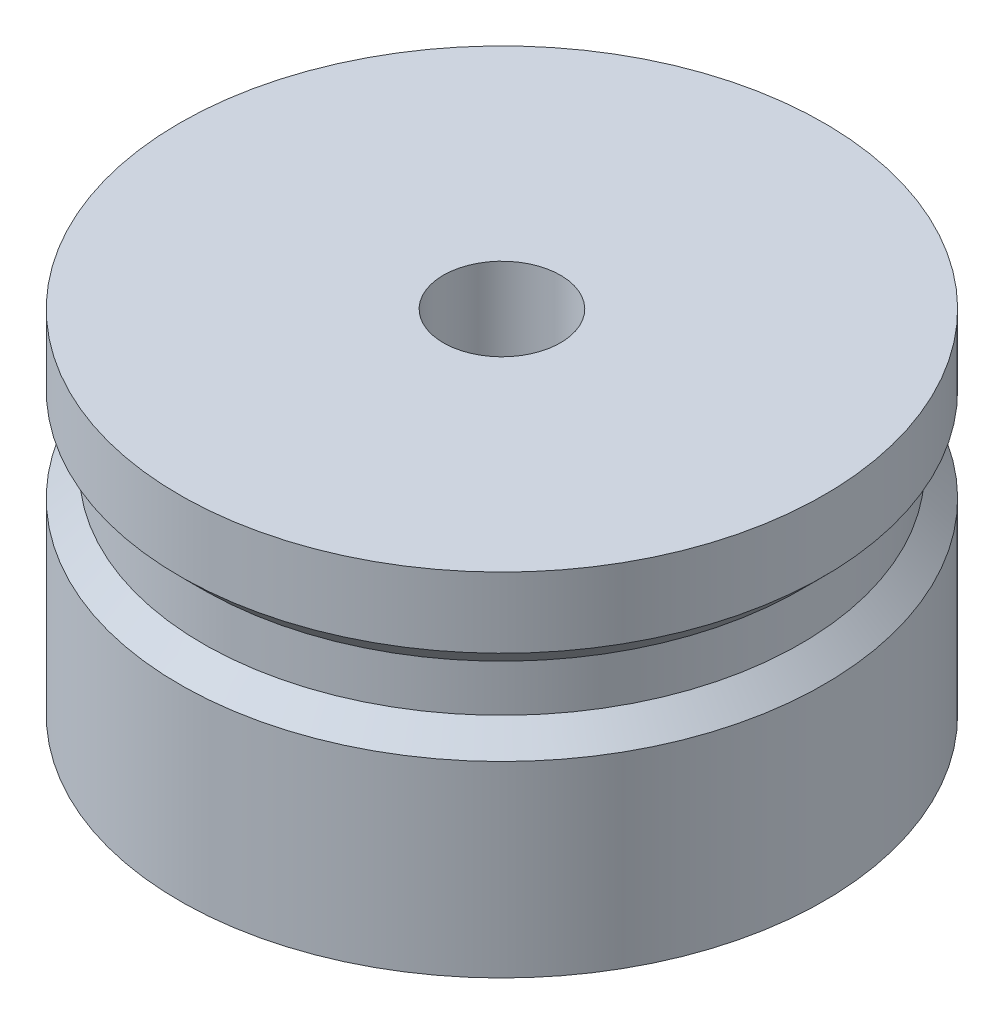
ISO-10303-21;
HEADER;
FILE_DESCRIPTION(('STEP AP214'),'2;1');
FILE_NAME('part.step','',(''),(''),'','','');
FILE_SCHEMA(('AUTOMOTIVE_DESIGN { 1 0 10303 214 1 1 1 1 }'));
ENDSEC;
DATA;
#1=APPLICATION_CONTEXT('core data for automotive mechanical design processes');
#2=APPLICATION_PROTOCOL_DEFINITION('international standard','automotive_design',2000,#1);
#3=PRODUCT_CONTEXT('',#1,'mechanical');
#4=PRODUCT('Part','Part','',(#3));
#5=PRODUCT_RELATED_PRODUCT_CATEGORY('part','',(#4));
#6=PRODUCT_DEFINITION_FORMATION('','',#4);
#7=PRODUCT_DEFINITION_CONTEXT('part definition',#1,'design');
#8=PRODUCT_DEFINITION('design','',#6,#7);
#9=PRODUCT_DEFINITION_SHAPE('','',#8);
#10=(LENGTH_UNIT() NAMED_UNIT(*) SI_UNIT(.MILLI.,.METRE.));
#11=(NAMED_UNIT(*) PLANE_ANGLE_UNIT() SI_UNIT($,.RADIAN.));
#12=(NAMED_UNIT(*) SI_UNIT($,.STERADIAN.) SOLID_ANGLE_UNIT());
#13=UNCERTAINTY_MEASURE_WITH_UNIT(LENGTH_MEASURE(1.E-05),#10,'distance_accuracy_value','');
#14=(GEOMETRIC_REPRESENTATION_CONTEXT(3) GLOBAL_UNCERTAINTY_ASSIGNED_CONTEXT((#13)) GLOBAL_UNIT_ASSIGNED_CONTEXT((#10,
#11,#12)) REPRESENTATION_CONTEXT('',''));
#15=CARTESIAN_POINT('',(0.,0.,0.));
#16=DIRECTION('',(0.,0.,1.));
#17=DIRECTION('',(1.,0.,0.));
#18=AXIS2_PLACEMENT_3D('',#15,#16,#17);
#19=CARTESIAN_POINT('',(27.5,0.,0.));
#20=DIRECTION('',(0.,-1.,0.));
#21=DIRECTION('',(1.,0.,0.));
#22=AXIS2_PLACEMENT_3D('',#19,#20,#21);
#23=PLANE('',#22);
#24=CARTESIAN_POINT('',(0.,0.,0.));
#25=DIRECTION('',(0.,1.,0.));
#26=DIRECTION('',(-1.,0.,0.));
#27=AXIS2_PLACEMENT_3D('',#24,#25,#26);
#28=CIRCLE('',#27,5.);
#29=CARTESIAN_POINT('',(-5.,0.,0.));
#30=VERTEX_POINT('',#29);
#31=EDGE_CURVE('E10',#30,#30,#28,.T.);
#32=ORIENTED_EDGE('',*,*,#31,.F.);
#33=EDGE_LOOP('',(#32));
#34=FACE_BOUND('',#33,.T.);
#35=CARTESIAN_POINT('',(0.,0.,0.));
#36=DIRECTION('',(0.,1.,0.));
#37=DIRECTION('',(-1.,0.,0.));
#38=AXIS2_PLACEMENT_3D('',#35,#36,#37);
#39=CIRCLE('',#38,27.5);
#40=CARTESIAN_POINT('',(-27.5,0.,0.));
#41=VERTEX_POINT('',#40);
#42=EDGE_CURVE('E59',#41,#41,#39,.T.);
#43=ORIENTED_EDGE('',*,*,#42,.T.);
#44=EDGE_LOOP('',(#43));
#45=FACE_BOUND('',#44,.T.);
#46=ADVANCED_FACE('F31',(#34,#45),#23,.F.);
#47=CARTESIAN_POINT('',(0.,0.,0.));
#48=DIRECTION('',(0.,1.,0.));
#49=DIRECTION('',(-1.,0.,0.));
#50=AXIS2_PLACEMENT_3D('',#47,#48,#49);
#51=CYLINDRICAL_SURFACE('',#50,5.);
#52=CARTESIAN_POINT('',(0.,-30.,0.));
#53=DIRECTION('',(0.,1.,0.));
#54=DIRECTION('',(-1.,0.,0.));
#55=AXIS2_PLACEMENT_3D('',#52,#53,#54);
#56=CIRCLE('',#55,5.);
#57=CARTESIAN_POINT('',(-5.,-30.,0.));
#58=VERTEX_POINT('',#57);
#59=EDGE_CURVE('E37',#58,#58,#56,.T.);
#60=ORIENTED_EDGE('',*,*,#59,.F.);
#61=EDGE_LOOP('',(#60));
#62=FACE_BOUND('',#61,.T.);
#63=ORIENTED_EDGE('',*,*,#31,.T.);
#64=EDGE_LOOP('',(#63));
#65=FACE_BOUND('',#64,.T.);
#66=ADVANCED_FACE('F96',(#62,#65),#51,.F.);
#67=CARTESIAN_POINT('',(5.,-30.,0.));
#68=DIRECTION('',(0.,1.,0.));
#69=DIRECTION('',(-1.,0.,0.));
#70=AXIS2_PLACEMENT_3D('',#67,#68,#69);
#71=PLANE('',#70);
#72=CARTESIAN_POINT('',(0.,-30.,0.));
#73=DIRECTION('',(0.,1.,0.));
#74=DIRECTION('',(-1.,0.,0.));
#75=AXIS2_PLACEMENT_3D('',#72,#73,#74);
#76=CIRCLE('',#75,27.5);
#77=CARTESIAN_POINT('',(-27.5,-30.,0.));
#78=VERTEX_POINT('',#77);
#79=EDGE_CURVE('E41',#78,#78,#76,.T.);
#80=ORIENTED_EDGE('',*,*,#79,.F.);
#81=EDGE_LOOP('',(#80));
#82=FACE_BOUND('',#81,.T.);
#83=ORIENTED_EDGE('',*,*,#59,.T.);
#84=EDGE_LOOP('',(#83));
#85=FACE_BOUND('',#84,.T.);
#86=ADVANCED_FACE('F91',(#82,#85),#71,.F.);
#87=CARTESIAN_POINT('',(0.,0.,0.));
#88=DIRECTION('',(0.,1.,0.));
#89=DIRECTION('',(-1.,0.,0.));
#90=AXIS2_PLACEMENT_3D('',#87,#88,#89);
#91=CYLINDRICAL_SURFACE('',#90,27.5);
#92=CARTESIAN_POINT('',(0.,-14.,0.));
#93=DIRECTION('',(0.,1.,0.));
#94=DIRECTION('',(-1.,0.,0.));
#95=AXIS2_PLACEMENT_3D('',#92,#93,#94);
#96=CIRCLE('',#95,27.5);
#97=CARTESIAN_POINT('',(-27.5,-14.,0.));
#98=VERTEX_POINT('',#97);
#99=EDGE_CURVE('E45',#98,#98,#96,.T.);
#100=ORIENTED_EDGE('',*,*,#99,.F.);
#101=EDGE_LOOP('',(#100));
#102=FACE_BOUND('',#101,.T.);
#103=ORIENTED_EDGE('',*,*,#79,.T.);
#104=EDGE_LOOP('',(#103));
#105=FACE_BOUND('',#104,.T.);
#106=ADVANCED_FACE('F85',(#102,#105),#91,.T.);
#107=CARTESIAN_POINT('',(0.,-14.,0.));
#108=DIRECTION('',(0.,-1.,0.));
#109=DIRECTION('',(1.,0.,0.));
#110=AXIS2_PLACEMENT_3D('',#107,#108,#109);
#111=CONICAL_SURFACE('',#110,27.5,0.785398163397445);
#112=CARTESIAN_POINT('',(0.,-12.,0.));
#113=DIRECTION('',(0.,1.,0.));
#114=DIRECTION('',(-1.,0.,0.));
#115=AXIS2_PLACEMENT_3D('',#112,#113,#114);
#116=CIRCLE('',#115,25.5);
#117=CARTESIAN_POINT('',(-25.5,-12.,0.));
#118=VERTEX_POINT('',#117);
#119=EDGE_CURVE('E50',#118,#118,#116,.T.);
#120=ORIENTED_EDGE('',*,*,#119,.F.);
#121=EDGE_LOOP('',(#120));
#122=FACE_BOUND('',#121,.T.);
#123=ORIENTED_EDGE('',*,*,#99,.T.);
#124=EDGE_LOOP('',(#123));
#125=FACE_BOUND('',#124,.T.);
#126=ADVANCED_FACE('F79',(#122,#125),#111,.T.);
#127=CARTESIAN_POINT('',(0.,0.,0.));
#128=DIRECTION('',(0.,1.,0.));
#129=DIRECTION('',(-1.,0.,0.));
#130=AXIS2_PLACEMENT_3D('',#127,#128,#129);
#131=CYLINDRICAL_SURFACE('',#130,25.5);
#132=CARTESIAN_POINT('',(0.,-8.00000000000001,0.));
#133=DIRECTION('',(0.,1.,0.));
#134=DIRECTION('',(-1.,0.,0.));
#135=AXIS2_PLACEMENT_3D('',#132,#133,#134);
#136=CIRCLE('',#135,25.5);
#137=CARTESIAN_POINT('',(-25.5,-8.00000000000001,0.));
#138=VERTEX_POINT('',#137);
#139=EDGE_CURVE('E53',#138,#138,#136,.T.);
#140=ORIENTED_EDGE('',*,*,#139,.F.);
#141=EDGE_LOOP('',(#140));
#142=FACE_BOUND('',#141,.T.);
#143=ORIENTED_EDGE('',*,*,#119,.T.);
#144=EDGE_LOOP('',(#143));
#145=FACE_BOUND('',#144,.T.);
#146=ADVANCED_FACE('F73',(#142,#145),#131,.T.);
#147=CARTESIAN_POINT('',(0.,-8.00000000000001,0.));
#148=DIRECTION('',(0.,1.,0.));
#149=DIRECTION('',(-1.,0.,0.));
#150=AXIS2_PLACEMENT_3D('',#147,#148,#149);
#151=CONICAL_SURFACE('',#150,25.5,0.785398163397447);
#152=CARTESIAN_POINT('',(0.,-6.,0.));
#153=DIRECTION('',(0.,1.,0.));
#154=DIRECTION('',(-1.,0.,0.));
#155=AXIS2_PLACEMENT_3D('',#152,#153,#154);
#156=CIRCLE('',#155,27.5);
#157=CARTESIAN_POINT('',(-27.5,-6.00000000000001,0.));
#158=VERTEX_POINT('',#157);
#159=EDGE_CURVE('E56',#158,#158,#156,.T.);
#160=ORIENTED_EDGE('',*,*,#159,.F.);
#161=EDGE_LOOP('',(#160));
#162=FACE_BOUND('',#161,.T.);
#163=ORIENTED_EDGE('',*,*,#139,.T.);
#164=EDGE_LOOP('',(#163));
#165=FACE_BOUND('',#164,.T.);
#166=ADVANCED_FACE('F67',(#162,#165),#151,.T.);
#167=CARTESIAN_POINT('',(0.,0.,0.));
#168=DIRECTION('',(0.,1.,0.));
#169=DIRECTION('',(-1.,0.,0.));
#170=AXIS2_PLACEMENT_3D('',#167,#168,#169);
#171=CYLINDRICAL_SURFACE('',#170,27.5);
#172=ORIENTED_EDGE('',*,*,#42,.F.);
#173=EDGE_LOOP('',(#172));
#174=FACE_BOUND('',#173,.T.);
#175=ORIENTED_EDGE('',*,*,#159,.T.);
#176=EDGE_LOOP('',(#175));
#177=FACE_BOUND('',#176,.T.);
#178=ADVANCED_FACE('F64',(#174,#177),#171,.T.);
#179=CLOSED_SHELL('',(#46,#66,#86,#106,#126,#146,#166,#178));
#180=MANIFOLD_SOLID_BREP('B2',#179);
#181=ADVANCED_BREP_SHAPE_REPRESENTATION('',(#18,#180),#14);
#182=SHAPE_DEFINITION_REPRESENTATION(#9,#181);
ENDSEC;
END-ISO-10303-21;
